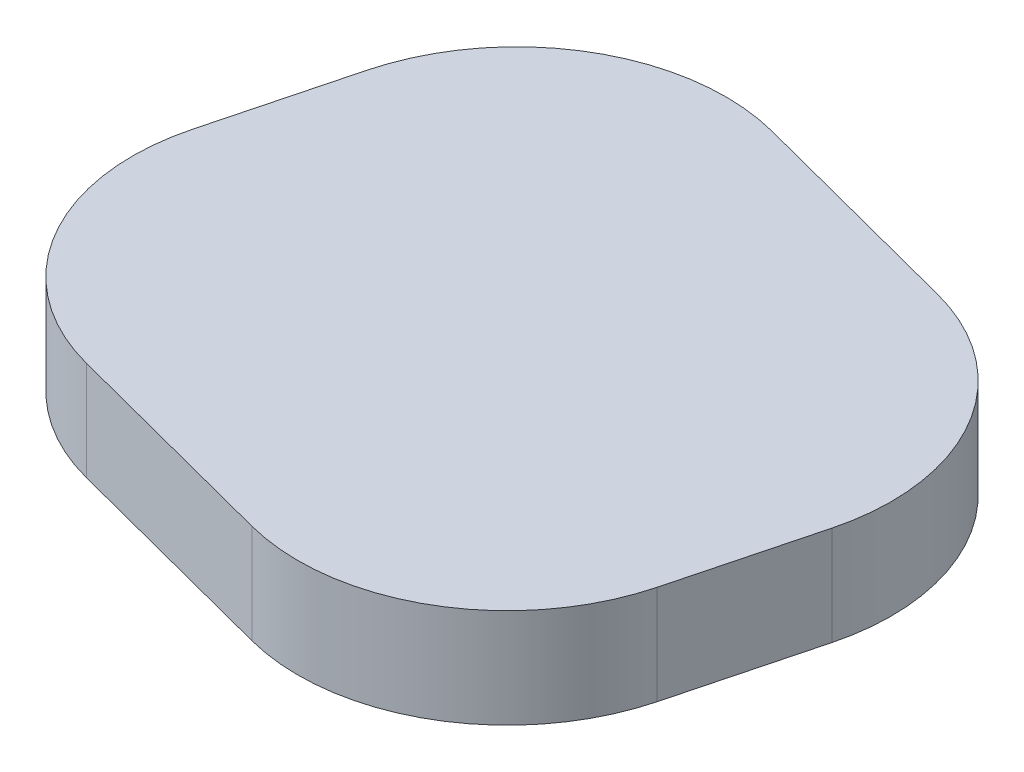
ISO-10303-21;
HEADER;
FILE_DESCRIPTION(('STEP AP214'),'2;1');
FILE_NAME('part.step','',(''),(''),'','','');
FILE_SCHEMA(('AUTOMOTIVE_DESIGN { 1 0 10303 214 1 1 1 1 }'));
ENDSEC;
DATA;
#1=APPLICATION_CONTEXT('core data for automotive mechanical design processes');
#2=APPLICATION_PROTOCOL_DEFINITION('international standard','automotive_design',2000,#1);
#3=PRODUCT_CONTEXT('',#1,'mechanical');
#4=PRODUCT('Part','Part','',(#3));
#5=PRODUCT_RELATED_PRODUCT_CATEGORY('part','',(#4));
#6=PRODUCT_DEFINITION_FORMATION('','',#4);
#7=PRODUCT_DEFINITION_CONTEXT('part definition',#1,'design');
#8=PRODUCT_DEFINITION('design','',#6,#7);
#9=PRODUCT_DEFINITION_SHAPE('','',#8);
#10=(LENGTH_UNIT() NAMED_UNIT(*) SI_UNIT(.MILLI.,.METRE.));
#11=(NAMED_UNIT(*) PLANE_ANGLE_UNIT() SI_UNIT($,.RADIAN.));
#12=(NAMED_UNIT(*) SI_UNIT($,.STERADIAN.) SOLID_ANGLE_UNIT());
#13=UNCERTAINTY_MEASURE_WITH_UNIT(LENGTH_MEASURE(1.E-05),#10,'distance_accuracy_value','');
#14=(GEOMETRIC_REPRESENTATION_CONTEXT(3) GLOBAL_UNCERTAINTY_ASSIGNED_CONTEXT((#13)) GLOBAL_UNIT_ASSIGNED_CONTEXT((#10,
#11,#12)) REPRESENTATION_CONTEXT('',''));
#15=CARTESIAN_POINT('',(0.,0.,0.));
#16=DIRECTION('',(0.,0.,1.));
#17=DIRECTION('',(1.,0.,0.));
#18=AXIS2_PLACEMENT_3D('',#15,#16,#17);
#19=CARTESIAN_POINT('',(-37.1334063168448,-20.,129.046218391989));
#20=DIRECTION('',(0.,-1.,0.));
#21=DIRECTION('',(0.,0.,-1.));
#22=AXIS2_PLACEMENT_3D('',#19,#20,#21);
#23=CYLINDRICAL_SURFACE('',#22,9.49999999999999);
#24=CARTESIAN_POINT('',(-37.1334063168448,-20.,129.046218391989));
#25=DIRECTION('',(0.,-1.,0.));
#26=DIRECTION('',(0.,0.,-1.));
#27=AXIS2_PLACEMENT_3D('',#24,#25,#26);
#28=CIRCLE('',#27,9.49999999999999);
#29=CARTESIAN_POINT('',(-46.3257693159565,-20.,126.648206195906));
#30=VERTEX_POINT('',#29);
#31=CARTESIAN_POINT('',(-34.7353941207621,-20.,119.853855392877));
#32=VERTEX_POINT('',#31);
#33=EDGE_CURVE('E11',#30,#32,#28,.T.);
#34=ORIENTED_EDGE('',*,*,#33,.T.);
#35=DIRECTION('',(0.,1.,0.));
#36=VECTOR('',#35,1.);
#37=CARTESIAN_POINT('',(-34.7353941207621,-20.,119.853855392877));
#38=LINE('',#37,#36);
#39=CARTESIAN_POINT('',(-34.7353941207621,-24.5,119.853855392877));
#40=VERTEX_POINT('',#39);
#41=EDGE_CURVE('E34',#40,#32,#38,.T.);
#42=ORIENTED_EDGE('',*,*,#41,.F.);
#43=CARTESIAN_POINT('',(-37.1334063168448,-24.5,129.046218391989));
#44=DIRECTION('',(0.,1.,0.));
#45=DIRECTION('',(1.,0.,0.));
#46=AXIS2_PLACEMENT_3D('',#43,#44,#45);
#47=CIRCLE('',#46,9.49999999999999);
#48=CARTESIAN_POINT('',(-46.3257693159565,-24.5,126.648206195906));
#49=VERTEX_POINT('',#48);
#50=EDGE_CURVE('E25',#40,#49,#47,.T.);
#51=ORIENTED_EDGE('',*,*,#50,.T.);
#52=DIRECTION('',(0.,1.,0.));
#53=VECTOR('',#52,1.);
#54=CARTESIAN_POINT('',(-46.3257693159566,-20.,126.648206195906));
#55=LINE('',#54,#53);
#56=EDGE_CURVE('E137',#49,#30,#55,.T.);
#57=ORIENTED_EDGE('',*,*,#56,.T.);
#58=EDGE_LOOP('',(#34,#42,#51,#57));
#59=FACE_BOUND('',#58,.T.);
#60=ADVANCED_FACE('F16',(#59),#23,.T.);
#61=CARTESIAN_POINT('',(-31.0121835428079,-24.5,147.178527449321));
#62=DIRECTION('',(0.,-1.,0.));
#63=DIRECTION('',(0.,0.,-1.));
#64=AXIS2_PLACEMENT_3D('',#61,#62,#63);
#65=PLANE('',#64);
#66=CARTESIAN_POINT('',(-26.9734261599318,-24.5,131.696652924502));
#67=DIRECTION('',(0.,1.,0.));
#68=DIRECTION('',(1.,0.,0.));
#69=AXIS2_PLACEMENT_3D('',#66,#67,#68);
#70=CIRCLE('',#69,9.49999999999999);
#71=CARTESIAN_POINT('',(-17.7810631608201,-24.5,134.094665120584));
#72=VERTEX_POINT('',#71);
#73=CARTESIAN_POINT('',(-24.5754139638491,-24.5,122.50428992539));
#74=VERTEX_POINT('',#73);
#75=EDGE_CURVE('E119',#72,#74,#70,.T.);
#76=ORIENTED_EDGE('',*,*,#75,.F.);
#77=DIRECTION('',(0.252422336429756,0.,-0.967617157801237));
#78=VECTOR('',#77,1.);
#79=CARTESIAN_POINT('',(-19.4218083476135,-24.5,140.384176646292));
#80=LINE('',#79,#78);
#81=CARTESIAN_POINT('',(-19.4218083476135,-24.5,140.384176646292));
#82=VERTEX_POINT('',#81);
#83=EDGE_CURVE('E125',#82,#72,#80,.T.);
#84=ORIENTED_EDGE('',*,*,#83,.F.);
#85=CARTESIAN_POINT('',(-28.6141713467252,-24.5,137.98616445021));
#86=DIRECTION('',(0.,1.,0.));
#87=DIRECTION('',(1.,0.,0.));
#88=AXIS2_PLACEMENT_3D('',#85,#86,#87);
#89=CIRCLE('',#88,9.50000000000001);
#90=CARTESIAN_POINT('',(-31.0121835428079,-24.5,147.178527449321));
#91=VERTEX_POINT('',#90);
#92=EDGE_CURVE('E94',#91,#82,#89,.T.);
#93=ORIENTED_EDGE('',*,*,#92,.F.);
#94=DIRECTION('',(0.967617157801237,0.,0.252422336429756));
#95=VECTOR('',#94,1.);
#96=CARTESIAN_POINT('',(-41.1721636997209,-24.5,144.528092916809));
#97=LINE('',#96,#95);
#98=CARTESIAN_POINT('',(-41.1721636997209,-24.5,144.528092916809));
#99=VERTEX_POINT('',#98);
#100=EDGE_CURVE('E86',#99,#91,#97,.T.);
#101=ORIENTED_EDGE('',*,*,#100,.F.);
#102=CARTESIAN_POINT('',(-38.7741515036382,-24.5,135.335729917697));
#103=DIRECTION('',(0.,1.,0.));
#104=DIRECTION('',(1.,0.,0.));
#105=AXIS2_PLACEMENT_3D('',#102,#103,#104);
#106=CIRCLE('',#105,9.50000000000001);
#107=CARTESIAN_POINT('',(-47.96651450275,-24.5,132.937717721615));
#108=VERTEX_POINT('',#107);
#109=EDGE_CURVE('E112',#108,#99,#106,.T.);
#110=ORIENTED_EDGE('',*,*,#109,.F.);
#111=DIRECTION('',(-0.252422336429756,0.,0.967617157801237));
#112=VECTOR('',#111,1.);
#113=CARTESIAN_POINT('',(-46.3257693159565,-24.5,126.648206195906));
#114=LINE('',#113,#112);
#115=EDGE_CURVE('E113',#49,#108,#114,.T.);
#116=ORIENTED_EDGE('',*,*,#115,.F.);
#117=ORIENTED_EDGE('',*,*,#50,.F.);
#118=DIRECTION('',(-0.967617157801236,0.,-0.252422336429757));
#119=VECTOR('',#118,1.);
#120=CARTESIAN_POINT('',(-24.5754139638491,-24.5,122.50428992539));
#121=LINE('',#120,#119);
#122=EDGE_CURVE('E116',#74,#40,#121,.T.);
#123=ORIENTED_EDGE('',*,*,#122,.F.);
#124=EDGE_LOOP('',(#76,#84,#93,#101,#110,#116,#117,#123));
#125=FACE_BOUND('',#124,.T.);
#126=ADVANCED_FACE('F151',(#125),#65,.T.);
#127=CARTESIAN_POINT('',(-38.7741515036382,-20.,135.335729917697));
#128=DIRECTION('',(0.,-1.,0.));
#129=DIRECTION('',(0.,0.,-1.));
#130=AXIS2_PLACEMENT_3D('',#127,#128,#129);
#131=CYLINDRICAL_SURFACE('',#130,9.50000000000001);
#132=CARTESIAN_POINT('',(-38.7741515036382,-20.,135.335729917697));
#133=DIRECTION('',(0.,-1.,0.));
#134=DIRECTION('',(0.,0.,-1.));
#135=AXIS2_PLACEMENT_3D('',#132,#133,#134);
#136=CIRCLE('',#135,9.50000000000001);
#137=CARTESIAN_POINT('',(-41.1721636997209,-20.,144.528092916809));
#138=VERTEX_POINT('',#137);
#139=CARTESIAN_POINT('',(-47.96651450275,-20.,132.937717721615));
#140=VERTEX_POINT('',#139);
#141=EDGE_CURVE('E100',#138,#140,#136,.T.);
#142=ORIENTED_EDGE('',*,*,#141,.T.);
#143=DIRECTION('',(0.,1.,0.));
#144=VECTOR('',#143,1.);
#145=CARTESIAN_POINT('',(-47.96651450275,-20.,132.937717721615));
#146=LINE('',#145,#144);
#147=EDGE_CURVE('E107',#108,#140,#146,.T.);
#148=ORIENTED_EDGE('',*,*,#147,.F.);
#149=ORIENTED_EDGE('',*,*,#109,.T.);
#150=DIRECTION('',(0.,-1.,0.));
#151=VECTOR('',#150,1.);
#152=CARTESIAN_POINT('',(-41.1721636997209,-20.,144.528092916809));
#153=LINE('',#152,#151);
#154=EDGE_CURVE('E101',#138,#99,#153,.T.);
#155=ORIENTED_EDGE('',*,*,#154,.F.);
#156=EDGE_LOOP('',(#142,#148,#149,#155));
#157=FACE_BOUND('',#156,.T.);
#158=ADVANCED_FACE('F176',(#157),#131,.T.);
#159=CARTESIAN_POINT('',(-46.3257693159565,-20.,126.648206195906));
#160=DIRECTION('',(-0.967617157801237,0.,-0.252422336429756));
#161=DIRECTION('',(-0.252422336429756,0.,0.967617157801237));
#162=AXIS2_PLACEMENT_3D('',#159,#160,#161);
#163=PLANE('',#162);
#164=DIRECTION('',(0.252422336429757,0.,-0.967617157801236));
#165=VECTOR('',#164,1.);
#166=CARTESIAN_POINT('',(-47.96651450275,-20.,132.937717721615));
#167=LINE('',#166,#165);
#168=EDGE_CURVE('E109',#140,#30,#167,.T.);
#169=ORIENTED_EDGE('',*,*,#168,.T.);
#170=ORIENTED_EDGE('',*,*,#56,.F.);
#171=ORIENTED_EDGE('',*,*,#115,.T.);
#172=ORIENTED_EDGE('',*,*,#147,.T.);
#173=EDGE_LOOP('',(#169,#170,#171,#172));
#174=FACE_BOUND('',#173,.T.);
#175=ADVANCED_FACE('F153',(#174),#163,.T.);
#176=CARTESIAN_POINT('',(-24.5754139638491,-20.,122.50428992539));
#177=DIRECTION('',(0.252422336429757,0.,-0.967617157801236));
#178=DIRECTION('',(-0.967617157801236,0.,-0.252422336429757));
#179=AXIS2_PLACEMENT_3D('',#176,#177,#178);
#180=PLANE('',#179);
#181=DIRECTION('',(0.967617157801236,0.,0.252422336429759));
#182=VECTOR('',#181,1.);
#183=CARTESIAN_POINT('',(-34.7353941207621,-20.,119.853855392877));
#184=LINE('',#183,#182);
#185=CARTESIAN_POINT('',(-24.5754139638491,-20.,122.50428992539));
#186=VERTEX_POINT('',#185);
#187=EDGE_CURVE('E114',#32,#186,#184,.T.);
#188=ORIENTED_EDGE('',*,*,#187,.T.);
#189=DIRECTION('',(0.,1.,0.));
#190=VECTOR('',#189,1.);
#191=CARTESIAN_POINT('',(-24.5754139638491,-20.,122.50428992539));
#192=LINE('',#191,#190);
#193=EDGE_CURVE('E117',#74,#186,#192,.T.);
#194=ORIENTED_EDGE('',*,*,#193,.F.);
#195=ORIENTED_EDGE('',*,*,#122,.T.);
#196=ORIENTED_EDGE('',*,*,#41,.T.);
#197=EDGE_LOOP('',(#188,#194,#195,#196));
#198=FACE_BOUND('',#197,.T.);
#199=ADVANCED_FACE('F157',(#198),#180,.T.);
#200=CARTESIAN_POINT('',(-26.9734261599318,-20.,131.696652924502));
#201=DIRECTION('',(0.,-1.,0.));
#202=DIRECTION('',(0.,0.,-1.));
#203=AXIS2_PLACEMENT_3D('',#200,#201,#202);
#204=CYLINDRICAL_SURFACE('',#203,9.49999999999999);
#205=CARTESIAN_POINT('',(-26.9734261599318,-20.,131.696652924502));
#206=DIRECTION('',(0.,-1.,0.));
#207=DIRECTION('',(0.,0.,-1.));
#208=AXIS2_PLACEMENT_3D('',#205,#206,#207);
#209=CIRCLE('',#208,9.49999999999999);
#210=CARTESIAN_POINT('',(-17.7810631608201,-20.,134.094665120584));
#211=VERTEX_POINT('',#210);
#212=EDGE_CURVE('E121',#186,#211,#209,.T.);
#213=ORIENTED_EDGE('',*,*,#212,.T.);
#214=DIRECTION('',(0.,1.,0.));
#215=VECTOR('',#214,1.);
#216=CARTESIAN_POINT('',(-17.7810631608201,-20.,134.094665120584));
#217=LINE('',#216,#215);
#218=EDGE_CURVE('E93',#72,#211,#217,.T.);
#219=ORIENTED_EDGE('',*,*,#218,.F.);
#220=ORIENTED_EDGE('',*,*,#75,.T.);
#221=ORIENTED_EDGE('',*,*,#193,.T.);
#222=EDGE_LOOP('',(#213,#219,#220,#221));
#223=FACE_BOUND('',#222,.T.);
#224=ADVANCED_FACE('F159',(#223),#204,.T.);
#225=CARTESIAN_POINT('',(-19.4218083476135,-20.,140.384176646292));
#226=DIRECTION('',(0.967617157801237,0.,0.252422336429756));
#227=DIRECTION('',(0.252422336429756,0.,-0.967617157801237));
#228=AXIS2_PLACEMENT_3D('',#225,#226,#227);
#229=PLANE('',#228);
#230=DIRECTION('',(-0.252422336429756,0.,0.967617157801237));
#231=VECTOR('',#230,1.);
#232=CARTESIAN_POINT('',(-17.7810631608201,-20.,134.094665120584));
#233=LINE('',#232,#231);
#234=CARTESIAN_POINT('',(-19.4218083476135,-20.,140.384176646292));
#235=VERTEX_POINT('',#234);
#236=EDGE_CURVE('E120',#211,#235,#233,.T.);
#237=ORIENTED_EDGE('',*,*,#236,.T.);
#238=DIRECTION('',(0.,1.,0.));
#239=VECTOR('',#238,1.);
#240=CARTESIAN_POINT('',(-19.4218083476135,-20.,140.384176646292));
#241=LINE('',#240,#239);
#242=EDGE_CURVE('E76',#82,#235,#241,.T.);
#243=ORIENTED_EDGE('',*,*,#242,.F.);
#244=ORIENTED_EDGE('',*,*,#83,.T.);
#245=ORIENTED_EDGE('',*,*,#218,.T.);
#246=EDGE_LOOP('',(#237,#243,#244,#245));
#247=FACE_BOUND('',#246,.T.);
#248=ADVANCED_FACE('F161',(#247),#229,.T.);
#249=CARTESIAN_POINT('',(-28.6141713467252,-20.,137.98616445021));
#250=DIRECTION('',(0.,-1.,0.));
#251=DIRECTION('',(0.,0.,-1.));
#252=AXIS2_PLACEMENT_3D('',#249,#250,#251);
#253=CYLINDRICAL_SURFACE('',#252,9.50000000000001);
#254=CARTESIAN_POINT('',(-28.6141713467252,-20.,137.98616445021));
#255=DIRECTION('',(0.,-1.,0.));
#256=DIRECTION('',(0.,0.,-1.));
#257=AXIS2_PLACEMENT_3D('',#254,#255,#256);
#258=CIRCLE('',#257,9.50000000000001);
#259=CARTESIAN_POINT('',(-31.0121835428079,-20.,147.178527449321));
#260=VERTEX_POINT('',#259);
#261=EDGE_CURVE('E89',#235,#260,#258,.T.);
#262=ORIENTED_EDGE('',*,*,#261,.T.);
#263=DIRECTION('',(0.,1.,0.));
#264=VECTOR('',#263,1.);
#265=CARTESIAN_POINT('',(-31.0121835428079,-20.,147.178527449321));
#266=LINE('',#265,#264);
#267=EDGE_CURVE('E82',#91,#260,#266,.T.);
#268=ORIENTED_EDGE('',*,*,#267,.F.);
#269=ORIENTED_EDGE('',*,*,#92,.T.);
#270=ORIENTED_EDGE('',*,*,#242,.T.);
#271=EDGE_LOOP('',(#262,#268,#269,#270));
#272=FACE_BOUND('',#271,.T.);
#273=ADVANCED_FACE('F90',(#272),#253,.T.);
#274=CARTESIAN_POINT('',(-41.1721636997209,-20.,144.528092916809));
#275=DIRECTION('',(-0.252422336429756,0.,0.967617157801237));
#276=DIRECTION('',(0.967617157801237,0.,0.252422336429756));
#277=AXIS2_PLACEMENT_3D('',#274,#275,#276);
#278=PLANE('',#277);
#279=DIRECTION('',(-0.967617157801236,0.,-0.252422336429758));
#280=VECTOR('',#279,1.);
#281=CARTESIAN_POINT('',(-31.0121835428079,-20.,147.178527449321));
#282=LINE('',#281,#280);
#283=EDGE_CURVE('E19',#260,#138,#282,.T.);
#284=ORIENTED_EDGE('',*,*,#283,.T.);
#285=ORIENTED_EDGE('',*,*,#154,.T.);
#286=ORIENTED_EDGE('',*,*,#100,.T.);
#287=ORIENTED_EDGE('',*,*,#267,.T.);
#288=EDGE_LOOP('',(#284,#285,#286,#287));
#289=FACE_BOUND('',#288,.T.);
#290=ADVANCED_FACE('F83',(#289),#278,.T.);
#291=CARTESIAN_POINT('',(-32.873788831785,-20.,133.516191421099));
#292=DIRECTION('',(0.,-1.,0.));
#293=DIRECTION('',(0.,0.,-1.));
#294=AXIS2_PLACEMENT_3D('',#291,#292,#293);
#295=PLANE('',#294);
#296=ORIENTED_EDGE('',*,*,#261,.F.);
#297=ORIENTED_EDGE('',*,*,#236,.F.);
#298=ORIENTED_EDGE('',*,*,#212,.F.);
#299=ORIENTED_EDGE('',*,*,#187,.F.);
#300=ORIENTED_EDGE('',*,*,#33,.F.);
#301=ORIENTED_EDGE('',*,*,#168,.F.);
#302=ORIENTED_EDGE('',*,*,#141,.F.);
#303=ORIENTED_EDGE('',*,*,#283,.F.);
#304=EDGE_LOOP('',(#296,#297,#298,#299,#300,#301,#302,#303));
#305=FACE_BOUND('',#304,.T.);
#306=ADVANCED_FACE('F97',(#305),#295,.F.);
#307=CLOSED_SHELL('',(#60,#126,#158,#175,#199,#224,#248,#273,#290,#306));
#308=MANIFOLD_SOLID_BREP('B1',#307);
#309=ADVANCED_BREP_SHAPE_REPRESENTATION('',(#18,#308),#14);
#310=SHAPE_DEFINITION_REPRESENTATION(#9,#309);
ENDSEC;
END-ISO-10303-21;
